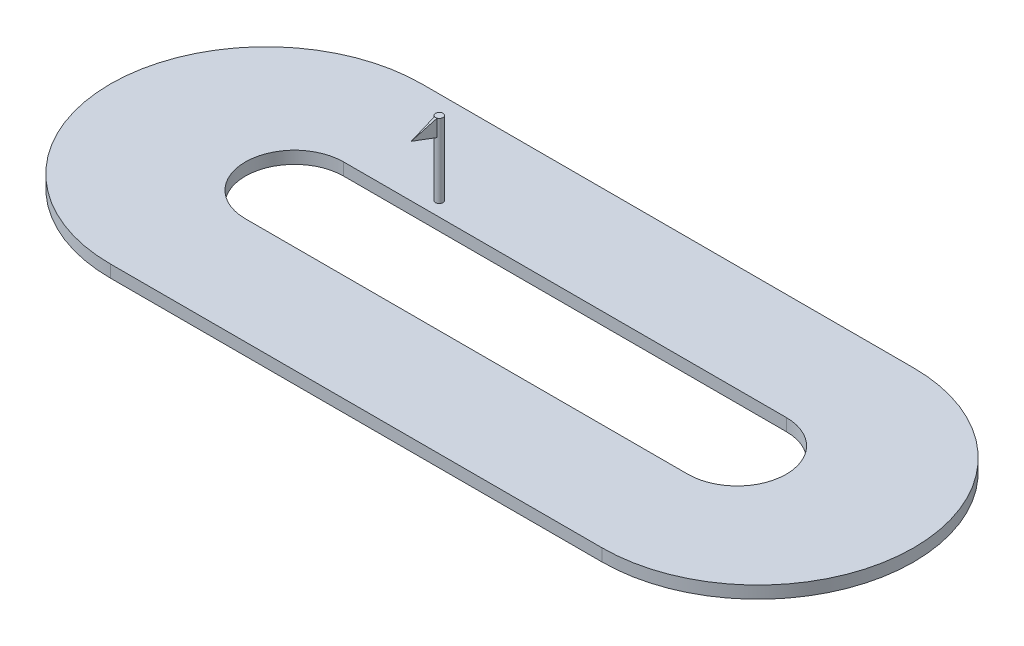
ISO-10303-21;
HEADER;
FILE_DESCRIPTION(('STEP AP214'),'2;1');
FILE_NAME('part.step','',(''),(''),'','','');
FILE_SCHEMA(('AUTOMOTIVE_DESIGN { 1 0 10303 214 1 1 1 1 }'));
ENDSEC;
DATA;
#1=APPLICATION_CONTEXT('core data for automotive mechanical design processes');
#2=APPLICATION_PROTOCOL_DEFINITION('international standard','automotive_design',2000,#1);
#3=PRODUCT_CONTEXT('',#1,'mechanical');
#4=PRODUCT('Part','Part','',(#3));
#5=PRODUCT_RELATED_PRODUCT_CATEGORY('part','',(#4));
#6=PRODUCT_DEFINITION_FORMATION('','',#4);
#7=PRODUCT_DEFINITION_CONTEXT('part definition',#1,'design');
#8=PRODUCT_DEFINITION('design','',#6,#7);
#9=PRODUCT_DEFINITION_SHAPE('','',#8);
#10=(LENGTH_UNIT() NAMED_UNIT(*) SI_UNIT(.MILLI.,.METRE.));
#11=(NAMED_UNIT(*) PLANE_ANGLE_UNIT() SI_UNIT($,.RADIAN.));
#12=(NAMED_UNIT(*) SI_UNIT($,.STERADIAN.) SOLID_ANGLE_UNIT());
#13=UNCERTAINTY_MEASURE_WITH_UNIT(LENGTH_MEASURE(1.E-05),#10,'distance_accuracy_value','');
#14=(GEOMETRIC_REPRESENTATION_CONTEXT(3) GLOBAL_UNCERTAINTY_ASSIGNED_CONTEXT((#13)) GLOBAL_UNIT_ASSIGNED_CONTEXT((#10,
#11,#12)) REPRESENTATION_CONTEXT('',''));
#15=CARTESIAN_POINT('',(0.,0.,0.));
#16=DIRECTION('',(0.,0.,1.));
#17=DIRECTION('',(1.,0.,0.));
#18=AXIS2_PLACEMENT_3D('',#15,#16,#17);
#19=CARTESIAN_POINT('',(-2186.38233519368,3500.,408.689063217764));
#20=DIRECTION('',(0.,-1.,0.));
#21=DIRECTION('',(0.,0.,-1.));
#22=AXIS2_PLACEMENT_3D('',#19,#20,#21);
#23=CYLINDRICAL_SURFACE('',#22,150.634589438444);
#24=CARTESIAN_POINT('',(-2186.38233519368,500.,408.689063217764));
#25=DIRECTION('',(0.,1.,0.));
#26=DIRECTION('',(0.,0.,1.));
#27=AXIS2_PLACEMENT_3D('',#24,#25,#26);
#28=CIRCLE('',#27,150.634589438444);
#29=CARTESIAN_POINT('',(-2186.38233519368,500.,559.323652656208));
#30=VERTEX_POINT('',#29);
#31=EDGE_CURVE('E195',#30,#30,#28,.T.);
#32=ORIENTED_EDGE('',*,*,#31,.T.);
#33=EDGE_LOOP('',(#32));
#34=FACE_BOUND('',#33,.T.);
#35=CARTESIAN_POINT('',(-2186.38233519368,2819.89046385257,408.689063217764));
#36=DIRECTION('',(0.,1.,0.));
#37=DIRECTION('',(0.,0.,1.));
#38=AXIS2_PLACEMENT_3D('',#35,#36,#37);
#39=CIRCLE('',#38,150.634589438444);
#40=CARTESIAN_POINT('',(-2186.38233519368,2819.89046385257,559.323652656208));
#41=VERTEX_POINT('',#40);
#42=CARTESIAN_POINT('',(-2132.20838770882,2819.89046385257,549.244970063388));
#43=VERTEX_POINT('',#42);
#44=EDGE_CURVE('E12',#41,#43,#39,.T.);
#45=ORIENTED_EDGE('',*,*,#44,.F.);
#46=CARTESIAN_POINT('',(-2236.45577830339,2819.89046385257,550.757461640594));
#47=VERTEX_POINT('',#46);
#48=EDGE_CURVE('E61',#47,#41,#39,.T.);
#49=ORIENTED_EDGE('',*,*,#48,.F.);
#50=DIRECTION('',(0.,-1.,0.));
#51=VECTOR('',#50,1.);
#52=CARTESIAN_POINT('',(-2236.45577830339,3500.,550.757461640594));
#53=LINE('',#52,#51);
#54=CARTESIAN_POINT('',(-2236.45577830339,3500.,550.757461640594));
#55=VERTEX_POINT('',#54);
#56=EDGE_CURVE('E193',#55,#47,#53,.T.);
#57=ORIENTED_EDGE('',*,*,#56,.F.);
#58=CARTESIAN_POINT('',(-2186.38233519368,3500.,408.689063217764));
#59=DIRECTION('',(0.,1.,0.));
#60=DIRECTION('',(0.,0.,1.));
#61=AXIS2_PLACEMENT_3D('',#58,#59,#60);
#62=CIRCLE('',#61,150.634589438444);
#63=CARTESIAN_POINT('',(-2132.20838770882,3500.,549.244970063388));
#64=VERTEX_POINT('',#63);
#65=EDGE_CURVE('E196',#64,#55,#62,.T.);
#66=ORIENTED_EDGE('',*,*,#65,.F.);
#67=DIRECTION('',(0.,-1.,0.));
#68=VECTOR('',#67,1.);
#69=CARTESIAN_POINT('',(-2132.20838770882,3500.,549.244970063388));
#70=LINE('',#69,#68);
#71=EDGE_CURVE('E72',#43,#64,#70,.F.);
#72=ORIENTED_EDGE('',*,*,#71,.F.);
#73=EDGE_LOOP('',(#45,#49,#57,#66,#72));
#74=FACE_BOUND('',#73,.T.);
#75=ADVANCED_FACE('F57',(#34,#74),#23,.T.);
#76=CARTESIAN_POINT('',(-6645.60085905861,500.,2991.64242992945));
#77=DIRECTION('',(0.,1.,0.));
#78=DIRECTION('',(0.,0.,1.));
#79=AXIS2_PLACEMENT_3D('',#76,#77,#78);
#80=PLANE('',#79);
#81=ORIENTED_EDGE('',*,*,#31,.F.);
#82=EDGE_LOOP('',(#81));
#83=FACE_BOUND('',#82,.T.);
#84=CARTESIAN_POINT('',(-6645.60085905861,500.,2991.64242992945));
#85=DIRECTION('',(0.,1.,0.));
#86=DIRECTION('',(0.,0.,1.));
#87=AXIS2_PLACEMENT_3D('',#84,#85,#86);
#88=CIRCLE('',#87,6336.95430070436);
#89=CARTESIAN_POINT('',(-6645.60085905861,500.,-3345.31187077491));
#90=VERTEX_POINT('',#89);
#91=CARTESIAN_POINT('',(-6645.60085905861,500.,9328.59673063382));
#92=VERTEX_POINT('',#91);
#93=EDGE_CURVE('E233',#90,#92,#88,.T.);
#94=ORIENTED_EDGE('',*,*,#93,.T.);
#95=DIRECTION('',(1.,0.,0.));
#96=VECTOR('',#95,1.);
#97=CARTESIAN_POINT('',(-6645.60085905861,500.,9328.59673063382));
#98=LINE('',#97,#96);
#99=CARTESIAN_POINT('',(13354.3991409414,500.,9328.59673063382));
#100=VERTEX_POINT('',#99);
#101=EDGE_CURVE('E236',#92,#100,#98,.T.);
#102=ORIENTED_EDGE('',*,*,#101,.T.);
#103=CARTESIAN_POINT('',(13354.3991409414,500.,2991.64242992945));
#104=DIRECTION('',(0.,1.,0.));
#105=DIRECTION('',(0.,0.,-1.));
#106=AXIS2_PLACEMENT_3D('',#103,#104,#105);
#107=CIRCLE('',#106,6336.95430070436);
#108=CARTESIAN_POINT('',(13354.3991409414,500.,-3345.31187077491));
#109=VERTEX_POINT('',#108);
#110=EDGE_CURVE('E239',#100,#109,#107,.T.);
#111=ORIENTED_EDGE('',*,*,#110,.T.);
#112=DIRECTION('',(-1.,0.,0.));
#113=VECTOR('',#112,1.);
#114=CARTESIAN_POINT('',(-6645.60085905861,500.,-3345.31187077491));
#115=LINE('',#114,#113);
#116=EDGE_CURVE('E241',#109,#90,#115,.T.);
#117=ORIENTED_EDGE('',*,*,#116,.T.);
#118=EDGE_LOOP('',(#94,#102,#111,#117));
#119=FACE_BOUND('',#118,.T.);
#120=DIRECTION('',(1.,0.,0.));
#121=VECTOR('',#120,1.);
#122=CARTESIAN_POINT('',(-5491.59431737794,500.,4991.64242992945));
#123=LINE('',#122,#121);
#124=CARTESIAN_POINT('',(-5491.59431737794,500.,4991.64242992945));
#125=VERTEX_POINT('',#124);
#126=CARTESIAN_POINT('',(12508.4056826221,500.,4991.64242992945));
#127=VERTEX_POINT('',#126);
#128=EDGE_CURVE('E204',#125,#127,#123,.T.);
#129=ORIENTED_EDGE('',*,*,#128,.F.);
#130=CARTESIAN_POINT('',(-5491.59431737794,500.,2991.64242992945));
#131=DIRECTION('',(0.,1.,0.));
#132=DIRECTION('',(0.,0.,-1.));
#133=AXIS2_PLACEMENT_3D('',#130,#131,#132);
#134=CIRCLE('',#133,2000.);
#135=CARTESIAN_POINT('',(-5491.59431737794,500.,991.642429929453));
#136=VERTEX_POINT('',#135);
#137=EDGE_CURVE('E202',#136,#125,#134,.T.);
#138=ORIENTED_EDGE('',*,*,#137,.F.);
#139=DIRECTION('',(-1.,0.,0.));
#140=VECTOR('',#139,1.);
#141=CARTESIAN_POINT('',(-5491.59431737794,500.,991.642429929453));
#142=LINE('',#141,#140);
#143=CARTESIAN_POINT('',(12508.4056826221,500.,991.642429929453));
#144=VERTEX_POINT('',#143);
#145=EDGE_CURVE('E210',#144,#136,#142,.T.);
#146=ORIENTED_EDGE('',*,*,#145,.F.);
#147=CARTESIAN_POINT('',(12508.4056826221,500.,2991.64242992945));
#148=DIRECTION('',(0.,1.,0.));
#149=DIRECTION('',(0.,0.,1.));
#150=AXIS2_PLACEMENT_3D('',#147,#148,#149);
#151=CIRCLE('',#150,2000.);
#152=EDGE_CURVE('E207',#127,#144,#151,.T.);
#153=ORIENTED_EDGE('',*,*,#152,.F.);
#154=EDGE_LOOP('',(#129,#138,#146,#153));
#155=FACE_BOUND('',#154,.T.);
#156=ADVANCED_FACE('F291',(#83,#119,#155),#80,.T.);
#157=CARTESIAN_POINT('',(-6645.60085905861,0.,2991.64242992945));
#158=DIRECTION('',(0.,1.,0.));
#159=DIRECTION('',(0.,0.,1.));
#160=AXIS2_PLACEMENT_3D('',#157,#158,#159);
#161=PLANE('',#160);
#162=CARTESIAN_POINT('',(-6645.60085905861,0.,2991.64242992945));
#163=DIRECTION('',(0.,1.,0.));
#164=DIRECTION('',(0.,0.,1.));
#165=AXIS2_PLACEMENT_3D('',#162,#163,#164);
#166=CIRCLE('',#165,6336.95430070436);
#167=CARTESIAN_POINT('',(-6645.60085905861,0.,-3345.31187077491));
#168=VERTEX_POINT('',#167);
#169=CARTESIAN_POINT('',(-6645.60085905861,0.,9328.59673063382));
#170=VERTEX_POINT('',#169);
#171=EDGE_CURVE('E232',#168,#170,#166,.T.);
#172=ORIENTED_EDGE('',*,*,#171,.F.);
#173=DIRECTION('',(-1.,0.,0.));
#174=VECTOR('',#173,1.);
#175=CARTESIAN_POINT('',(-6645.60085905861,0.,-3345.31187077491));
#176=LINE('',#175,#174);
#177=CARTESIAN_POINT('',(13354.3991409414,0.,-3345.31187077491));
#178=VERTEX_POINT('',#177);
#179=EDGE_CURVE('E237',#178,#168,#176,.T.);
#180=ORIENTED_EDGE('',*,*,#179,.F.);
#181=CARTESIAN_POINT('',(13354.3991409414,0.,2991.64242992945));
#182=DIRECTION('',(0.,1.,0.));
#183=DIRECTION('',(0.,0.,-1.));
#184=AXIS2_PLACEMENT_3D('',#181,#182,#183);
#185=CIRCLE('',#184,6336.95430070436);
#186=CARTESIAN_POINT('',(13354.3991409414,0.,9328.59673063382));
#187=VERTEX_POINT('',#186);
#188=EDGE_CURVE('E248',#187,#178,#185,.T.);
#189=ORIENTED_EDGE('',*,*,#188,.F.);
#190=DIRECTION('',(1.,0.,0.));
#191=VECTOR('',#190,1.);
#192=CARTESIAN_POINT('',(-6645.60085905861,0.,9328.59673063382));
#193=LINE('',#192,#191);
#194=EDGE_CURVE('E246',#170,#187,#193,.T.);
#195=ORIENTED_EDGE('',*,*,#194,.F.);
#196=EDGE_LOOP('',(#172,#180,#189,#195));
#197=FACE_BOUND('',#196,.T.);
#198=CARTESIAN_POINT('',(-5491.59431737794,0.,2991.64242992945));
#199=DIRECTION('',(0.,1.,0.));
#200=DIRECTION('',(0.,0.,-1.));
#201=AXIS2_PLACEMENT_3D('',#198,#199,#200);
#202=CIRCLE('',#201,2000.);
#203=CARTESIAN_POINT('',(-5491.59431737794,0.,991.642429929453));
#204=VERTEX_POINT('',#203);
#205=CARTESIAN_POINT('',(-5491.59431737794,0.,4991.64242992945));
#206=VERTEX_POINT('',#205);
#207=EDGE_CURVE('E199',#204,#206,#202,.T.);
#208=ORIENTED_EDGE('',*,*,#207,.T.);
#209=DIRECTION('',(1.,0.,0.));
#210=VECTOR('',#209,1.);
#211=CARTESIAN_POINT('',(-5491.59431737794,0.,4991.64242992945));
#212=LINE('',#211,#210);
#213=CARTESIAN_POINT('',(12508.4056826221,0.,4991.64242992945));
#214=VERTEX_POINT('',#213);
#215=EDGE_CURVE('E215',#206,#214,#212,.T.);
#216=ORIENTED_EDGE('',*,*,#215,.T.);
#217=CARTESIAN_POINT('',(12508.4056826221,0.,2991.64242992945));
#218=DIRECTION('',(0.,1.,0.));
#219=DIRECTION('',(0.,0.,1.));
#220=AXIS2_PLACEMENT_3D('',#217,#218,#219);
#221=CIRCLE('',#220,2000.);
#222=CARTESIAN_POINT('',(12508.4056826221,0.,991.642429929453));
#223=VERTEX_POINT('',#222);
#224=EDGE_CURVE('E218',#214,#223,#221,.T.);
#225=ORIENTED_EDGE('',*,*,#224,.T.);
#226=DIRECTION('',(-1.,0.,0.));
#227=VECTOR('',#226,1.);
#228=CARTESIAN_POINT('',(-5491.59431737794,0.,991.642429929453));
#229=LINE('',#228,#227);
#230=EDGE_CURVE('E205',#223,#204,#229,.T.);
#231=ORIENTED_EDGE('',*,*,#230,.T.);
#232=EDGE_LOOP('',(#208,#216,#225,#231));
#233=FACE_BOUND('',#232,.T.);
#234=ADVANCED_FACE('F298',(#197,#233),#161,.F.);
#235=CARTESIAN_POINT('',(-6645.60085905861,500.,2991.64242992945));
#236=DIRECTION('',(0.,-1.,0.));
#237=DIRECTION('',(0.,0.,-1.));
#238=AXIS2_PLACEMENT_3D('',#235,#236,#237);
#239=CYLINDRICAL_SURFACE('',#238,6336.95430070436);
#240=ORIENTED_EDGE('',*,*,#171,.T.);
#241=DIRECTION('',(0.,-1.,0.));
#242=VECTOR('',#241,1.);
#243=CARTESIAN_POINT('',(-6645.60085905861,500.,9328.59673063382));
#244=LINE('',#243,#242);
#245=EDGE_CURVE('E258',#92,#170,#244,.T.);
#246=ORIENTED_EDGE('',*,*,#245,.F.);
#247=ORIENTED_EDGE('',*,*,#93,.F.);
#248=DIRECTION('',(0.,-1.,0.));
#249=VECTOR('',#248,1.);
#250=CARTESIAN_POINT('',(-6645.60085905861,500.,-3345.31187077491));
#251=LINE('',#250,#249);
#252=EDGE_CURVE('E243',#90,#168,#251,.T.);
#253=ORIENTED_EDGE('',*,*,#252,.T.);
#254=EDGE_LOOP('',(#240,#246,#247,#253));
#255=FACE_BOUND('',#254,.T.);
#256=ADVANCED_FACE('F59',(#255),#239,.T.);
#257=CARTESIAN_POINT('',(-6645.60085905861,500.,9328.59673063382));
#258=DIRECTION('',(0.,0.,-1.));
#259=DIRECTION('',(-1.,0.,0.));
#260=AXIS2_PLACEMENT_3D('',#257,#258,#259);
#261=PLANE('',#260);
#262=ORIENTED_EDGE('',*,*,#194,.T.);
#263=DIRECTION('',(0.,-1.,0.));
#264=VECTOR('',#263,1.);
#265=CARTESIAN_POINT('',(13354.3991409414,500.,9328.59673063382));
#266=LINE('',#265,#264);
#267=EDGE_CURVE('E256',#100,#187,#266,.T.);
#268=ORIENTED_EDGE('',*,*,#267,.F.);
#269=ORIENTED_EDGE('',*,*,#101,.F.);
#270=ORIENTED_EDGE('',*,*,#245,.T.);
#271=EDGE_LOOP('',(#262,#268,#269,#270));
#272=FACE_BOUND('',#271,.T.);
#273=ADVANCED_FACE('F328',(#272),#261,.F.);
#274=CARTESIAN_POINT('',(13354.3991409414,500.,2991.64242992945));
#275=DIRECTION('',(0.,-1.,0.));
#276=DIRECTION('',(0.,0.,-1.));
#277=AXIS2_PLACEMENT_3D('',#274,#275,#276);
#278=CYLINDRICAL_SURFACE('',#277,6336.95430070436);
#279=ORIENTED_EDGE('',*,*,#188,.T.);
#280=DIRECTION('',(0.,-1.,0.));
#281=VECTOR('',#280,1.);
#282=CARTESIAN_POINT('',(13354.3991409414,500.,-3345.31187077491));
#283=LINE('',#282,#281);
#284=EDGE_CURVE('E253',#109,#178,#283,.T.);
#285=ORIENTED_EDGE('',*,*,#284,.F.);
#286=ORIENTED_EDGE('',*,*,#110,.F.);
#287=ORIENTED_EDGE('',*,*,#267,.T.);
#288=EDGE_LOOP('',(#279,#285,#286,#287));
#289=FACE_BOUND('',#288,.T.);
#290=ADVANCED_FACE('F325',(#289),#278,.T.);
#291=CARTESIAN_POINT('',(-6645.60085905861,500.,-3345.31187077491));
#292=DIRECTION('',(0.,0.,1.));
#293=DIRECTION('',(1.,0.,0.));
#294=AXIS2_PLACEMENT_3D('',#291,#292,#293);
#295=PLANE('',#294);
#296=ORIENTED_EDGE('',*,*,#179,.T.);
#297=ORIENTED_EDGE('',*,*,#252,.F.);
#298=ORIENTED_EDGE('',*,*,#116,.F.);
#299=ORIENTED_EDGE('',*,*,#284,.T.);
#300=EDGE_LOOP('',(#296,#297,#298,#299));
#301=FACE_BOUND('',#300,.T.);
#302=ADVANCED_FACE('F317',(#301),#295,.F.);
#303=CARTESIAN_POINT('',(-5491.59431737794,500.,2991.64242992945));
#304=DIRECTION('',(0.,-1.,0.));
#305=DIRECTION('',(0.,0.,-1.));
#306=AXIS2_PLACEMENT_3D('',#303,#304,#305);
#307=CYLINDRICAL_SURFACE('',#306,2000.);
#308=ORIENTED_EDGE('',*,*,#207,.F.);
#309=DIRECTION('',(0.,-1.,0.));
#310=VECTOR('',#309,1.);
#311=CARTESIAN_POINT('',(-5491.59431737794,500.,991.642429929453));
#312=LINE('',#311,#310);
#313=EDGE_CURVE('E212',#136,#204,#312,.T.);
#314=ORIENTED_EDGE('',*,*,#313,.F.);
#315=ORIENTED_EDGE('',*,*,#137,.T.);
#316=DIRECTION('',(0.,-1.,0.));
#317=VECTOR('',#316,1.);
#318=CARTESIAN_POINT('',(-5491.59431737794,500.,4991.64242992945));
#319=LINE('',#318,#317);
#320=EDGE_CURVE('E229',#125,#206,#319,.T.);
#321=ORIENTED_EDGE('',*,*,#320,.T.);
#322=EDGE_LOOP('',(#308,#314,#315,#321));
#323=FACE_BOUND('',#322,.T.);
#324=ADVANCED_FACE('F314',(#323),#307,.F.);
#325=CARTESIAN_POINT('',(-5491.59431737794,500.,4991.64242992945));
#326=DIRECTION('',(0.,0.,-1.));
#327=DIRECTION('',(-1.,0.,0.));
#328=AXIS2_PLACEMENT_3D('',#325,#326,#327);
#329=PLANE('',#328);
#330=ORIENTED_EDGE('',*,*,#215,.F.);
#331=ORIENTED_EDGE('',*,*,#320,.F.);
#332=ORIENTED_EDGE('',*,*,#128,.T.);
#333=DIRECTION('',(0.,-1.,0.));
#334=VECTOR('',#333,1.);
#335=CARTESIAN_POINT('',(12508.4056826221,500.,4991.64242992945));
#336=LINE('',#335,#334);
#337=EDGE_CURVE('E227',#127,#214,#336,.T.);
#338=ORIENTED_EDGE('',*,*,#337,.T.);
#339=EDGE_LOOP('',(#330,#331,#332,#338));
#340=FACE_BOUND('',#339,.T.);
#341=ADVANCED_FACE('F310',(#340),#329,.T.);
#342=CARTESIAN_POINT('',(12508.4056826221,500.,2991.64242992945));
#343=DIRECTION('',(0.,-1.,0.));
#344=DIRECTION('',(0.,0.,-1.));
#345=AXIS2_PLACEMENT_3D('',#342,#343,#344);
#346=CYLINDRICAL_SURFACE('',#345,2000.);
#347=ORIENTED_EDGE('',*,*,#224,.F.);
#348=ORIENTED_EDGE('',*,*,#337,.F.);
#349=ORIENTED_EDGE('',*,*,#152,.T.);
#350=DIRECTION('',(0.,-1.,0.));
#351=VECTOR('',#350,1.);
#352=CARTESIAN_POINT('',(12508.4056826221,500.,991.642429929453));
#353=LINE('',#352,#351);
#354=EDGE_CURVE('E225',#144,#223,#353,.T.);
#355=ORIENTED_EDGE('',*,*,#354,.T.);
#356=EDGE_LOOP('',(#347,#348,#349,#355));
#357=FACE_BOUND('',#356,.T.);
#358=ADVANCED_FACE('F306',(#357),#346,.F.);
#359=CARTESIAN_POINT('',(-5491.59431737794,500.,991.642429929453));
#360=DIRECTION('',(0.,0.,1.));
#361=DIRECTION('',(1.,0.,0.));
#362=AXIS2_PLACEMENT_3D('',#359,#360,#361);
#363=PLANE('',#362);
#364=ORIENTED_EDGE('',*,*,#230,.F.);
#365=ORIENTED_EDGE('',*,*,#354,.F.);
#366=ORIENTED_EDGE('',*,*,#145,.T.);
#367=ORIENTED_EDGE('',*,*,#313,.T.);
#368=EDGE_LOOP('',(#364,#365,#366,#367));
#369=FACE_BOUND('',#368,.T.);
#370=ADVANCED_FACE('F303',(#369),#363,.T.);
#371=CARTESIAN_POINT('',(-2186.38233519368,3500.,408.689063217764));
#372=DIRECTION('',(0.,1.,0.));
#373=DIRECTION('',(0.,0.,1.));
#374=AXIS2_PLACEMENT_3D('',#371,#372,#373);
#375=PLANE('',#374);
#376=DIRECTION('',(0.,0.,1.));
#377=VECTOR('',#376,1.);
#378=CARTESIAN_POINT('',(-2236.45577830339,3500.,509.323652656208));
#379=LINE('',#378,#377);
#380=CARTESIAN_POINT('',(-2236.45577830339,3500.,559.323652656208));
#381=VERTEX_POINT('',#380);
#382=EDGE_CURVE('E186',#55,#381,#379,.T.);
#383=ORIENTED_EDGE('',*,*,#382,.T.);
#384=DIRECTION('',(1.,0.,0.));
#385=VECTOR('',#384,1.);
#386=CARTESIAN_POINT('',(-2236.45577830339,3500.,559.323652656208));
#387=LINE('',#386,#385);
#388=CARTESIAN_POINT('',(-2132.20838770882,3500.,559.323652656208));
#389=VERTEX_POINT('',#388);
#390=EDGE_CURVE('E180',#381,#389,#387,.T.);
#391=ORIENTED_EDGE('',*,*,#390,.T.);
#392=DIRECTION('',(0.,0.,1.));
#393=VECTOR('',#392,1.);
#394=CARTESIAN_POINT('',(-2132.20838770882,3500.,509.323652656208));
#395=LINE('',#394,#393);
#396=EDGE_CURVE('E175',#64,#389,#395,.T.);
#397=ORIENTED_EDGE('',*,*,#396,.F.);
#398=ORIENTED_EDGE('',*,*,#65,.T.);
#399=EDGE_LOOP('',(#383,#391,#397,#398));
#400=FACE_BOUND('',#399,.T.);
#401=ADVANCED_FACE('F270',(#400),#375,.T.);
#402=CARTESIAN_POINT('',(-2132.20838770882,2819.89046385257,509.323652656208));
#403=DIRECTION('',(0.,1.,0.));
#404=DIRECTION('',(0.,0.,1.));
#405=AXIS2_PLACEMENT_3D('',#402,#403,#404);
#406=PLANE('',#405);
#407=DIRECTION('',(-1.,0.,0.));
#408=VECTOR('',#407,1.);
#409=CARTESIAN_POINT('',(-2132.20838770882,2819.89046385257,559.323652656208));
#410=LINE('',#409,#408);
#411=CARTESIAN_POINT('',(-2132.20838770882,2819.89046385257,559.323652656208));
#412=VERTEX_POINT('',#411);
#413=EDGE_CURVE('E149',#412,#41,#410,.T.);
#414=ORIENTED_EDGE('',*,*,#413,.T.);
#415=ORIENTED_EDGE('',*,*,#44,.T.);
#416=DIRECTION('',(0.,0.,1.));
#417=VECTOR('',#416,1.);
#418=CARTESIAN_POINT('',(-2132.20838770882,2819.89046385257,509.323652656208));
#419=LINE('',#418,#417);
#420=EDGE_CURVE('E172',#43,#412,#419,.T.);
#421=ORIENTED_EDGE('',*,*,#420,.T.);
#422=EDGE_LOOP('',(#414,#415,#421));
#423=FACE_BOUND('',#422,.T.);
#424=ADVANCED_FACE('F173',(#423),#406,.F.);
#425=CARTESIAN_POINT('',(-2236.45577830339,2819.89046385257,509.323652656208));
#426=DIRECTION('',(1.,0.,0.));
#427=DIRECTION('',(0.,0.,-1.));
#428=AXIS2_PLACEMENT_3D('',#425,#426,#427);
#429=PLANE('',#428);
#430=ORIENTED_EDGE('',*,*,#382,.F.);
#431=ORIENTED_EDGE('',*,*,#56,.T.);
#432=DIRECTION('',(0.,0.,1.));
#433=VECTOR('',#432,1.);
#434=CARTESIAN_POINT('',(-2236.45577830339,2819.89046385257,509.323652656208));
#435=LINE('',#434,#433);
#436=CARTESIAN_POINT('',(-2236.45577830339,2819.89046385257,559.323652656208));
#437=VERTEX_POINT('',#436);
#438=EDGE_CURVE('E189',#47,#437,#435,.T.);
#439=ORIENTED_EDGE('',*,*,#438,.T.);
#440=DIRECTION('',(0.,1.,0.));
#441=VECTOR('',#440,1.);
#442=CARTESIAN_POINT('',(-2236.45577830339,2819.89046385257,559.323652656208));
#443=LINE('',#442,#441);
#444=EDGE_CURVE('E159',#437,#381,#443,.T.);
#445=ORIENTED_EDGE('',*,*,#444,.T.);
#446=EDGE_LOOP('',(#430,#431,#439,#445));
#447=FACE_BOUND('',#446,.T.);
#448=ADVANCED_FACE('F268',(#447),#429,.F.);
#449=CARTESIAN_POINT('',(-2132.20838770882,3500.,509.323652656208));
#450=DIRECTION('',(-1.,0.,0.));
#451=DIRECTION('',(0.,0.,1.));
#452=AXIS2_PLACEMENT_3D('',#449,#450,#451);
#453=PLANE('',#452);
#454=ORIENTED_EDGE('',*,*,#420,.F.);
#455=ORIENTED_EDGE('',*,*,#71,.T.);
#456=ORIENTED_EDGE('',*,*,#396,.T.);
#457=DIRECTION('',(0.,-1.,0.));
#458=VECTOR('',#457,1.);
#459=CARTESIAN_POINT('',(-2132.20838770882,3500.,559.323652656208));
#460=LINE('',#459,#458);
#461=EDGE_CURVE('E166',#389,#412,#460,.T.);
#462=ORIENTED_EDGE('',*,*,#461,.T.);
#463=EDGE_LOOP('',(#454,#455,#456,#462));
#464=FACE_BOUND('',#463,.T.);
#465=ADVANCED_FACE('F177',(#464),#453,.F.);
#466=ORIENTED_EDGE('',*,*,#438,.F.);
#467=ORIENTED_EDGE('',*,*,#48,.T.);
#468=EDGE_CURVE('E156',#41,#437,#410,.T.);
#469=ORIENTED_EDGE('',*,*,#468,.T.);
#470=EDGE_LOOP('',(#466,#467,#469));
#471=FACE_BOUND('',#470,.T.);
#472=ADVANCED_FACE('F264',(#471),#406,.F.);
#473=CARTESIAN_POINT('',(-2236.45577830339,3500.,559.323652656208));
#474=DIRECTION('',(-0.998629534754574,0.,0.052335956242944));
#475=DIRECTION('',(0.052335956242944,0.,0.998629534754574));
#476=AXIS2_PLACEMENT_3D('',#473,#474,#475);
#477=PLANE('',#476);
#478=ORIENTED_EDGE('',*,*,#444,.F.);
#479=DIRECTION('',(-0.0495284859891472,-0.323123633503386,-0.945059811095146));
#480=VECTOR('',#479,1.);
#481=CARTESIAN_POINT('',(-2225.5714247449,2890.89994051866,767.009490663193));
#482=LINE('',#481,#480);
#483=CARTESIAN_POINT('',(-2184.3320830061,3159.94523192629,1553.90300729317));
#484=VERTEX_POINT('',#483);
#485=EDGE_CURVE('E169',#437,#484,#482,.F.);
#486=ORIENTED_EDGE('',*,*,#485,.T.);
#487=DIRECTION('',(0.0495284859891472,-0.323123633503386,0.945059811095146));
#488=VECTOR('',#487,1.);
#489=CARTESIAN_POINT('',(-2236.45577830339,3500.,559.323652656208));
#490=LINE('',#489,#488);
#491=EDGE_CURVE('E275',#484,#381,#490,.F.);
#492=ORIENTED_EDGE('',*,*,#491,.T.);
#493=EDGE_LOOP('',(#478,#486,#492));
#494=FACE_BOUND('',#493,.T.);
#495=ADVANCED_FACE('F277',(#494),#477,.T.);
#496=CARTESIAN_POINT('',(-2132.20838770882,3500.,559.323652656208));
#497=DIRECTION('',(0.998629534754574,0.,0.052335956242944));
#498=DIRECTION('',(0.052335956242944,0.,-0.998629534754574));
#499=AXIS2_PLACEMENT_3D('',#496,#497,#498);
#500=PLANE('',#499);
#501=DIRECTION('',(0.0495284859891472,0.323123633503386,-0.945059811095146));
#502=VECTOR('',#501,1.);
#503=CARTESIAN_POINT('',(-2132.20838770882,3500.,559.323652656208));
#504=LINE('',#503,#502);
#505=EDGE_CURVE('E168',#389,#484,#504,.F.);
#506=ORIENTED_EDGE('',*,*,#505,.T.);
#507=DIRECTION('',(-0.0495284859891472,0.323123633503386,0.945059811095146));
#508=VECTOR('',#507,1.);
#509=CARTESIAN_POINT('',(-2143.0927412673,2890.89994051866,767.009490663193));
#510=LINE('',#509,#508);
#511=EDGE_CURVE('E153',#484,#412,#510,.F.);
#512=ORIENTED_EDGE('',*,*,#511,.T.);
#513=ORIENTED_EDGE('',*,*,#461,.F.);
#514=EDGE_LOOP('',(#506,#512,#513));
#515=FACE_BOUND('',#514,.T.);
#516=ADVANCED_FACE('F164',(#515),#500,.T.);
#517=CARTESIAN_POINT('',(-3035.74774575524,3304.89160907855,1129.96931254841));
#518=DIRECTION('',(0.,-0.946221097442967,-0.32352068674789));
#519=DIRECTION('',(0.,0.32352068674789,-0.946221097442967));
#520=AXIS2_PLACEMENT_3D('',#517,#518,#519);
#521=PLANE('',#520);
#522=ORIENTED_EDGE('',*,*,#505,.F.);
#523=ORIENTED_EDGE('',*,*,#390,.F.);
#524=ORIENTED_EDGE('',*,*,#491,.F.);
#525=EDGE_LOOP('',(#522,#523,#524));
#526=FACE_BOUND('',#525,.T.);
#527=ADVANCED_FACE('F274',(#526),#521,.F.);
#528=CARTESIAN_POINT('',(-3035.74774575524,2353.52350780024,-804.68882333997));
#529=DIRECTION('',(0.,0.946221097442968,-0.32352068674789));
#530=DIRECTION('',(0.,0.32352068674789,0.946221097442968));
#531=AXIS2_PLACEMENT_3D('',#528,#529,#530);
#532=PLANE('',#531);
#533=ORIENTED_EDGE('',*,*,#468,.F.);
#534=ORIENTED_EDGE('',*,*,#413,.F.);
#535=ORIENTED_EDGE('',*,*,#511,.F.);
#536=ORIENTED_EDGE('',*,*,#485,.F.);
#537=EDGE_LOOP('',(#533,#534,#535,#536));
#538=FACE_BOUND('',#537,.T.);
#539=ADVANCED_FACE('F151',(#538),#532,.F.);
#540=CLOSED_SHELL('',(#75,#156,#234,#256,#273,#290,#302,#324,#341,#358,#370,#401,#424,#448,#465,
#472,#495,#516,#527,#539));
#541=MANIFOLD_SOLID_BREP('B2',#540);
#542=ADVANCED_BREP_SHAPE_REPRESENTATION('',(#18,#541),#14);
#543=SHAPE_DEFINITION_REPRESENTATION(#9,#542);
ENDSEC;
END-ISO-10303-21;
